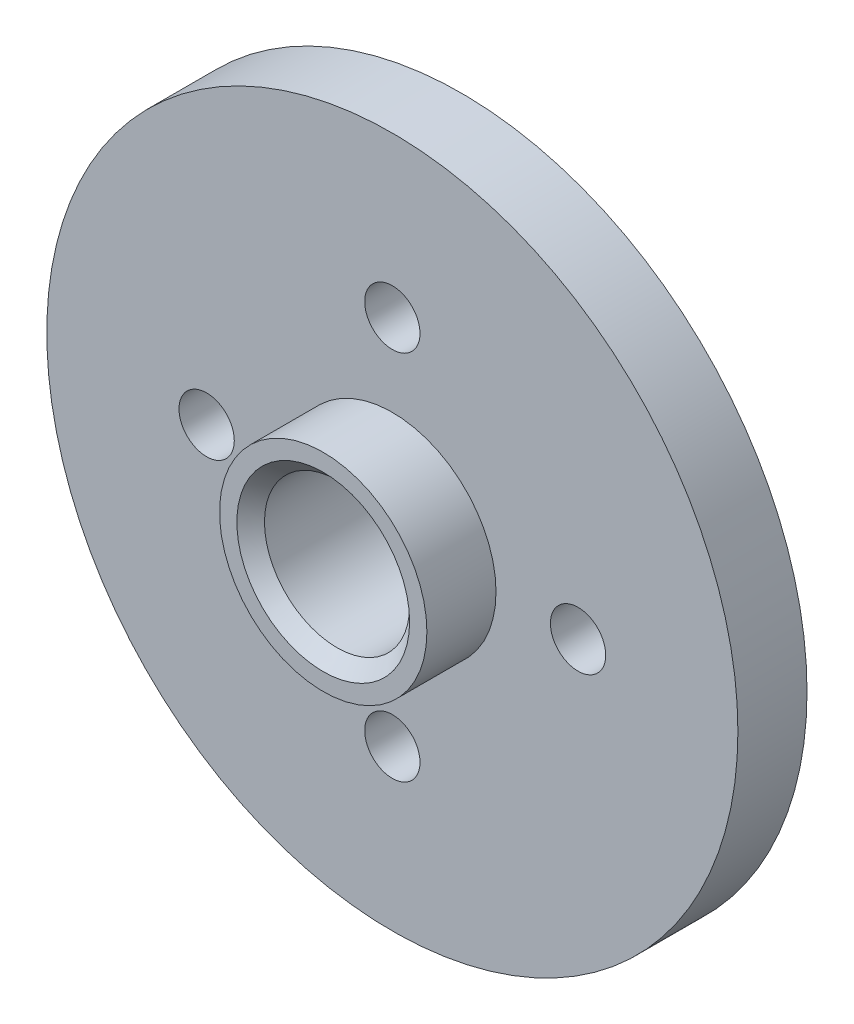
ISO-10303-21;
HEADER;
FILE_DESCRIPTION(('STEP AP214'),'2;1');
FILE_NAME('part.step','',(''),(''),'','','');
FILE_SCHEMA(('AUTOMOTIVE_DESIGN { 1 0 10303 214 1 1 1 1 }'));
ENDSEC;
DATA;
#1=APPLICATION_CONTEXT('core data for automotive mechanical design processes');
#2=APPLICATION_PROTOCOL_DEFINITION('international standard','automotive_design',2000,#1);
#3=PRODUCT_CONTEXT('',#1,'mechanical');
#4=PRODUCT('Part','Part','',(#3));
#5=PRODUCT_RELATED_PRODUCT_CATEGORY('part','',(#4));
#6=PRODUCT_DEFINITION_FORMATION('','',#4);
#7=PRODUCT_DEFINITION_CONTEXT('part definition',#1,'design');
#8=PRODUCT_DEFINITION('design','',#6,#7);
#9=PRODUCT_DEFINITION_SHAPE('','',#8);
#10=(LENGTH_UNIT() NAMED_UNIT(*) SI_UNIT(.MILLI.,.METRE.));
#11=(NAMED_UNIT(*) PLANE_ANGLE_UNIT() SI_UNIT($,.RADIAN.));
#12=(NAMED_UNIT(*) SI_UNIT($,.STERADIAN.) SOLID_ANGLE_UNIT());
#13=UNCERTAINTY_MEASURE_WITH_UNIT(LENGTH_MEASURE(1.E-05),#10,'distance_accuracy_value','');
#14=(GEOMETRIC_REPRESENTATION_CONTEXT(3) GLOBAL_UNCERTAINTY_ASSIGNED_CONTEXT((#13)) GLOBAL_UNIT_ASSIGNED_CONTEXT((#10,
#11,#12)) REPRESENTATION_CONTEXT('',''));
#15=CARTESIAN_POINT('',(0.,0.,0.));
#16=DIRECTION('',(0.,0.,1.));
#17=DIRECTION('',(1.,0.,0.));
#18=AXIS2_PLACEMENT_3D('',#15,#16,#17);
#19=CARTESIAN_POINT('',(0.,0.,10.));
#20=DIRECTION('',(0.,0.,1.));
#21=DIRECTION('',(1.,0.,0.));
#22=AXIS2_PLACEMENT_3D('',#19,#20,#21);
#23=PLANE('',#22);
#24=CARTESIAN_POINT('',(-26.8700576850888,0.,10.));
#25=DIRECTION('',(0.,0.,1.));
#26=DIRECTION('',(1.,0.,0.));
#27=AXIS2_PLACEMENT_3D('',#24,#25,#26);
#28=CIRCLE('',#27,4.00000000000001);
#29=CARTESIAN_POINT('',(-22.8700576850888,0.,10.));
#30=VERTEX_POINT('',#29);
#31=EDGE_CURVE('E65',#30,#30,#28,.T.);
#32=ORIENTED_EDGE('',*,*,#31,.F.);
#33=EDGE_LOOP('',(#32));
#34=FACE_BOUND('',#33,.T.);
#35=CARTESIAN_POINT('',(26.8700576850888,0.,10.));
#36=DIRECTION('',(0.,0.,1.));
#37=DIRECTION('',(1.,0.,0.));
#38=AXIS2_PLACEMENT_3D('',#35,#36,#37);
#39=CIRCLE('',#38,4.00000000000001);
#40=CARTESIAN_POINT('',(30.8700576850888,0.,10.));
#41=VERTEX_POINT('',#40);
#42=EDGE_CURVE('E53',#41,#41,#39,.T.);
#43=ORIENTED_EDGE('',*,*,#42,.F.);
#44=EDGE_LOOP('',(#43));
#45=FACE_BOUND('',#44,.T.);
#46=CARTESIAN_POINT('',(0.,0.,10.));
#47=DIRECTION('',(0.,0.,1.));
#48=DIRECTION('',(1.,0.,0.));
#49=AXIS2_PLACEMENT_3D('',#46,#47,#48);
#50=CIRCLE('',#49,50.);
#51=CARTESIAN_POINT('',(50.,0.,10.));
#52=VERTEX_POINT('',#51);
#53=EDGE_CURVE('E40',#52,#52,#50,.T.);
#54=ORIENTED_EDGE('',*,*,#53,.T.);
#55=EDGE_LOOP('',(#54));
#56=FACE_BOUND('',#55,.T.);
#57=CARTESIAN_POINT('',(0.,26.8700576850888,10.));
#58=DIRECTION('',(0.,0.,1.));
#59=DIRECTION('',(1.,0.,0.));
#60=AXIS2_PLACEMENT_3D('',#57,#58,#59);
#61=CIRCLE('',#60,4.00000000000001);
#62=CARTESIAN_POINT('',(4.00000000000001,26.8700576850888,10.));
#63=VERTEX_POINT('',#62);
#64=EDGE_CURVE('E48',#63,#63,#61,.T.);
#65=ORIENTED_EDGE('',*,*,#64,.F.);
#66=EDGE_LOOP('',(#65));
#67=FACE_BOUND('',#66,.T.);
#68=CARTESIAN_POINT('',(0.,-26.8700576850888,10.));
#69=DIRECTION('',(0.,0.,1.));
#70=DIRECTION('',(1.,0.,0.));
#71=AXIS2_PLACEMENT_3D('',#68,#69,#70);
#72=CIRCLE('',#71,4.00000000000001);
#73=CARTESIAN_POINT('',(4.00000000000001,-26.8700576850888,10.));
#74=VERTEX_POINT('',#73);
#75=EDGE_CURVE('E59',#74,#74,#72,.T.);
#76=ORIENTED_EDGE('',*,*,#75,.F.);
#77=EDGE_LOOP('',(#76));
#78=FACE_BOUND('',#77,.T.);
#79=CARTESIAN_POINT('',(0.,0.,10.));
#80=DIRECTION('',(0.,0.,1.));
#81=DIRECTION('',(1.,0.,0.));
#82=AXIS2_PLACEMENT_3D('',#79,#80,#81);
#83=CIRCLE('',#82,15.);
#84=CARTESIAN_POINT('',(15.,0.,10.));
#85=VERTEX_POINT('',#84);
#86=EDGE_CURVE('E74',#85,#85,#83,.T.);
#87=ORIENTED_EDGE('',*,*,#86,.F.);
#88=EDGE_LOOP('',(#87));
#89=FACE_BOUND('',#88,.T.);
#90=ADVANCED_FACE('F29',(#34,#45,#56,#67,#78,#89),#23,.T.);
#91=CARTESIAN_POINT('',(0.,0.,0.));
#92=DIRECTION('',(0.,0.,1.));
#93=DIRECTION('',(1.,0.,0.));
#94=AXIS2_PLACEMENT_3D('',#91,#92,#93);
#95=PLANE('',#94);
#96=CARTESIAN_POINT('',(0.,0.,0.));
#97=DIRECTION('',(0.,0.,-1.));
#98=DIRECTION('',(-1.,0.,0.));
#99=AXIS2_PLACEMENT_3D('',#96,#97,#98);
#100=CIRCLE('',#99,12.025);
#101=CARTESIAN_POINT('',(-12.025,0.,0.));
#102=VERTEX_POINT('',#101);
#103=EDGE_CURVE('E82',#102,#102,#100,.T.);
#104=ORIENTED_EDGE('',*,*,#103,.F.);
#105=EDGE_LOOP('',(#104));
#106=FACE_BOUND('',#105,.T.);
#107=CARTESIAN_POINT('',(0.,-26.8700576850888,0.));
#108=DIRECTION('',(0.,0.,1.));
#109=DIRECTION('',(1.,0.,0.));
#110=AXIS2_PLACEMENT_3D('',#107,#108,#109);
#111=CIRCLE('',#110,4.00000000000001);
#112=CARTESIAN_POINT('',(4.00000000000001,-26.8700576850888,0.));
#113=VERTEX_POINT('',#112);
#114=EDGE_CURVE('E62',#113,#113,#111,.T.);
#115=ORIENTED_EDGE('',*,*,#114,.T.);
#116=EDGE_LOOP('',(#115));
#117=FACE_BOUND('',#116,.T.);
#118=CARTESIAN_POINT('',(0.,26.8700576850888,0.));
#119=DIRECTION('',(0.,0.,1.));
#120=DIRECTION('',(1.,0.,0.));
#121=AXIS2_PLACEMENT_3D('',#118,#119,#120);
#122=CIRCLE('',#121,4.00000000000001);
#123=CARTESIAN_POINT('',(4.00000000000001,26.8700576850888,0.));
#124=VERTEX_POINT('',#123);
#125=EDGE_CURVE('E50',#124,#124,#122,.T.);
#126=ORIENTED_EDGE('',*,*,#125,.T.);
#127=EDGE_LOOP('',(#126));
#128=FACE_BOUND('',#127,.T.);
#129=CARTESIAN_POINT('',(0.,0.,0.));
#130=DIRECTION('',(0.,0.,1.));
#131=DIRECTION('',(1.,0.,0.));
#132=AXIS2_PLACEMENT_3D('',#129,#130,#131);
#133=CIRCLE('',#132,50.);
#134=CARTESIAN_POINT('',(50.,0.,0.));
#135=VERTEX_POINT('',#134);
#136=EDGE_CURVE('E44',#135,#135,#133,.T.);
#137=ORIENTED_EDGE('',*,*,#136,.F.);
#138=EDGE_LOOP('',(#137));
#139=FACE_BOUND('',#138,.T.);
#140=CARTESIAN_POINT('',(26.8700576850888,0.,0.));
#141=DIRECTION('',(0.,0.,1.));
#142=DIRECTION('',(1.,0.,0.));
#143=AXIS2_PLACEMENT_3D('',#140,#141,#142);
#144=CIRCLE('',#143,4.00000000000001);
#145=CARTESIAN_POINT('',(30.8700576850888,0.,0.));
#146=VERTEX_POINT('',#145);
#147=EDGE_CURVE('E56',#146,#146,#144,.T.);
#148=ORIENTED_EDGE('',*,*,#147,.T.);
#149=EDGE_LOOP('',(#148));
#150=FACE_BOUND('',#149,.T.);
#151=CARTESIAN_POINT('',(-26.8700576850888,0.,0.));
#152=DIRECTION('',(0.,0.,1.));
#153=DIRECTION('',(1.,0.,0.));
#154=AXIS2_PLACEMENT_3D('',#151,#152,#153);
#155=CIRCLE('',#154,4.00000000000001);
#156=CARTESIAN_POINT('',(-22.8700576850888,0.,0.));
#157=VERTEX_POINT('',#156);
#158=EDGE_CURVE('E68',#157,#157,#155,.T.);
#159=ORIENTED_EDGE('',*,*,#158,.T.);
#160=EDGE_LOOP('',(#159));
#161=FACE_BOUND('',#160,.T.);
#162=ADVANCED_FACE('F88',(#106,#117,#128,#139,#150,#161),#95,.F.);
#163=CARTESIAN_POINT('',(0.,0.,10.));
#164=DIRECTION('',(0.,0.,-1.));
#165=DIRECTION('',(-1.,0.,0.));
#166=AXIS2_PLACEMENT_3D('',#163,#164,#165);
#167=CYLINDRICAL_SURFACE('',#166,50.);
#168=ORIENTED_EDGE('',*,*,#53,.F.);
#169=EDGE_LOOP('',(#168));
#170=FACE_BOUND('',#169,.T.);
#171=ORIENTED_EDGE('',*,*,#136,.T.);
#172=EDGE_LOOP('',(#171));
#173=FACE_BOUND('',#172,.T.);
#174=ADVANCED_FACE('F91',(#170,#173),#167,.T.);
#175=CARTESIAN_POINT('',(0.,26.8700576850888,10.));
#176=DIRECTION('',(0.,0.,-1.));
#177=DIRECTION('',(-1.,0.,0.));
#178=AXIS2_PLACEMENT_3D('',#175,#176,#177);
#179=CYLINDRICAL_SURFACE('',#178,4.00000000000001);
#180=ORIENTED_EDGE('',*,*,#64,.T.);
#181=EDGE_LOOP('',(#180));
#182=FACE_BOUND('',#181,.T.);
#183=ORIENTED_EDGE('',*,*,#125,.F.);
#184=EDGE_LOOP('',(#183));
#185=FACE_BOUND('',#184,.T.);
#186=ADVANCED_FACE('F127',(#182,#185),#179,.F.);
#187=CARTESIAN_POINT('',(26.8700576850888,0.,10.));
#188=DIRECTION('',(0.,0.,-1.));
#189=DIRECTION('',(-1.,0.,0.));
#190=AXIS2_PLACEMENT_3D('',#187,#188,#189);
#191=CYLINDRICAL_SURFACE('',#190,4.00000000000001);
#192=ORIENTED_EDGE('',*,*,#42,.T.);
#193=EDGE_LOOP('',(#192));
#194=FACE_BOUND('',#193,.T.);
#195=ORIENTED_EDGE('',*,*,#147,.F.);
#196=EDGE_LOOP('',(#195));
#197=FACE_BOUND('',#196,.T.);
#198=ADVANCED_FACE('F116',(#194,#197),#191,.F.);
#199=CARTESIAN_POINT('',(0.,-26.8700576850888,10.));
#200=DIRECTION('',(0.,0.,-1.));
#201=DIRECTION('',(-1.,0.,0.));
#202=AXIS2_PLACEMENT_3D('',#199,#200,#201);
#203=CYLINDRICAL_SURFACE('',#202,4.00000000000001);
#204=ORIENTED_EDGE('',*,*,#75,.T.);
#205=EDGE_LOOP('',(#204));
#206=FACE_BOUND('',#205,.T.);
#207=ORIENTED_EDGE('',*,*,#114,.F.);
#208=EDGE_LOOP('',(#207));
#209=FACE_BOUND('',#208,.T.);
#210=ADVANCED_FACE('F106',(#206,#209),#203,.F.);
#211=CARTESIAN_POINT('',(-26.8700576850888,0.,10.));
#212=DIRECTION('',(0.,0.,-1.));
#213=DIRECTION('',(-1.,0.,0.));
#214=AXIS2_PLACEMENT_3D('',#211,#212,#213);
#215=CYLINDRICAL_SURFACE('',#214,4.00000000000001);
#216=ORIENTED_EDGE('',*,*,#31,.T.);
#217=EDGE_LOOP('',(#216));
#218=FACE_BOUND('',#217,.T.);
#219=ORIENTED_EDGE('',*,*,#158,.F.);
#220=EDGE_LOOP('',(#219));
#221=FACE_BOUND('',#220,.T.);
#222=ADVANCED_FACE('F103',(#218,#221),#215,.F.);
#223=CARTESIAN_POINT('',(0.,0.,20.));
#224=DIRECTION('',(0.,0.,-1.));
#225=DIRECTION('',(-1.,0.,0.));
#226=AXIS2_PLACEMENT_3D('',#223,#224,#225);
#227=CYLINDRICAL_SURFACE('',#226,15.);
#228=CARTESIAN_POINT('',(0.,0.,20.));
#229=DIRECTION('',(0.,0.,1.));
#230=DIRECTION('',(1.,0.,0.));
#231=AXIS2_PLACEMENT_3D('',#228,#229,#230);
#232=CIRCLE('',#231,15.);
#233=CARTESIAN_POINT('',(15.,0.,20.));
#234=VERTEX_POINT('',#233);
#235=EDGE_CURVE('E71',#234,#234,#232,.T.);
#236=ORIENTED_EDGE('',*,*,#235,.F.);
#237=EDGE_LOOP('',(#236));
#238=FACE_BOUND('',#237,.T.);
#239=ORIENTED_EDGE('',*,*,#86,.T.);
#240=EDGE_LOOP('',(#239));
#241=FACE_BOUND('',#240,.T.);
#242=ADVANCED_FACE('F105',(#238,#241),#227,.T.);
#243=CARTESIAN_POINT('',(0.,0.,20.));
#244=DIRECTION('',(0.,0.,1.));
#245=DIRECTION('',(1.,0.,0.));
#246=AXIS2_PLACEMENT_3D('',#243,#244,#245);
#247=PLANE('',#246);
#248=CARTESIAN_POINT('',(0.,0.,20.));
#249=DIRECTION('',(0.,0.,1.));
#250=DIRECTION('',(1.,0.,0.));
#251=AXIS2_PLACEMENT_3D('',#248,#249,#250);
#252=CIRCLE('',#251,12.5);
#253=CARTESIAN_POINT('',(12.5,0.,20.));
#254=VERTEX_POINT('',#253);
#255=EDGE_CURVE('E36',#254,#254,#252,.F.);
#256=ORIENTED_EDGE('',*,*,#255,.T.);
#257=EDGE_LOOP('',(#256));
#258=FACE_BOUND('',#257,.T.);
#259=ORIENTED_EDGE('',*,*,#235,.T.);
#260=EDGE_LOOP('',(#259));
#261=FACE_BOUND('',#260,.T.);
#262=ADVANCED_FACE('F113',(#258,#261),#247,.T.);
#263=CARTESIAN_POINT('',(0.,0.,0.));
#264=DIRECTION('',(0.,0.,-1.));
#265=DIRECTION('',(-1.,0.,0.));
#266=AXIS2_PLACEMENT_3D('',#263,#264,#265);
#267=CYLINDRICAL_SURFACE('',#266,10.5);
#268=CARTESIAN_POINT('',(0.,0.,18.));
#269=DIRECTION('',(0.,0.,1.));
#270=DIRECTION('',(1.,0.,0.));
#271=AXIS2_PLACEMENT_3D('',#268,#269,#270);
#272=CIRCLE('',#271,10.5);
#273=CARTESIAN_POINT('',(10.5,0.,18.));
#274=VERTEX_POINT('',#273);
#275=EDGE_CURVE('E10',#274,#274,#272,.T.);
#276=ORIENTED_EDGE('',*,*,#275,.T.);
#277=EDGE_LOOP('',(#276));
#278=FACE_BOUND('',#277,.T.);
#279=CARTESIAN_POINT('',(0.,0.,0.880459160514182));
#280=DIRECTION('',(0.,0.,-1.));
#281=DIRECTION('',(-1.,0.,0.));
#282=AXIS2_PLACEMENT_3D('',#279,#280,#281);
#283=CIRCLE('',#282,10.5);
#284=CARTESIAN_POINT('',(-10.5,0.,0.880459160514182));
#285=VERTEX_POINT('',#284);
#286=EDGE_CURVE('E77',#285,#285,#283,.T.);
#287=ORIENTED_EDGE('',*,*,#286,.T.);
#288=EDGE_LOOP('',(#287));
#289=FACE_BOUND('',#288,.T.);
#290=ADVANCED_FACE('F191',(#278,#289),#267,.F.);
#291=CARTESIAN_POINT('',(0.,0.,0.));
#292=DIRECTION('',(0.,0.,-1.));
#293=DIRECTION('',(-1.,0.,0.));
#294=AXIS2_PLACEMENT_3D('',#291,#292,#293);
#295=CONICAL_SURFACE('',#294,12.025,1.0471975511966);
#296=ORIENTED_EDGE('',*,*,#286,.F.);
#297=EDGE_LOOP('',(#296));
#298=FACE_BOUND('',#297,.T.);
#299=ORIENTED_EDGE('',*,*,#103,.T.);
#300=EDGE_LOOP('',(#299));
#301=FACE_BOUND('',#300,.T.);
#302=ADVANCED_FACE('F86',(#298,#301),#295,.F.);
#303=CARTESIAN_POINT('',(0.,0.,20.));
#304=DIRECTION('',(0.,0.,1.));
#305=DIRECTION('',(1.,0.,0.));
#306=AXIS2_PLACEMENT_3D('',#303,#304,#305);
#307=CONICAL_SURFACE('',#306,12.5,0.785398163397444);
#308=ORIENTED_EDGE('',*,*,#275,.F.);
#309=EDGE_LOOP('',(#308));
#310=FACE_BOUND('',#309,.T.);
#311=ORIENTED_EDGE('',*,*,#255,.F.);
#312=EDGE_LOOP('',(#311));
#313=FACE_BOUND('',#312,.T.);
#314=ADVANCED_FACE('F31',(#310,#313),#307,.F.);
#315=CLOSED_SHELL('',(#90,#162,#174,#186,#198,#210,#222,#242,#262,#290,#302,#314));
#316=MANIFOLD_SOLID_BREP('B2',#315);
#317=ADVANCED_BREP_SHAPE_REPRESENTATION('',(#18,#316),#14);
#318=SHAPE_DEFINITION_REPRESENTATION(#9,#317);
ENDSEC;
END-ISO-10303-21;
